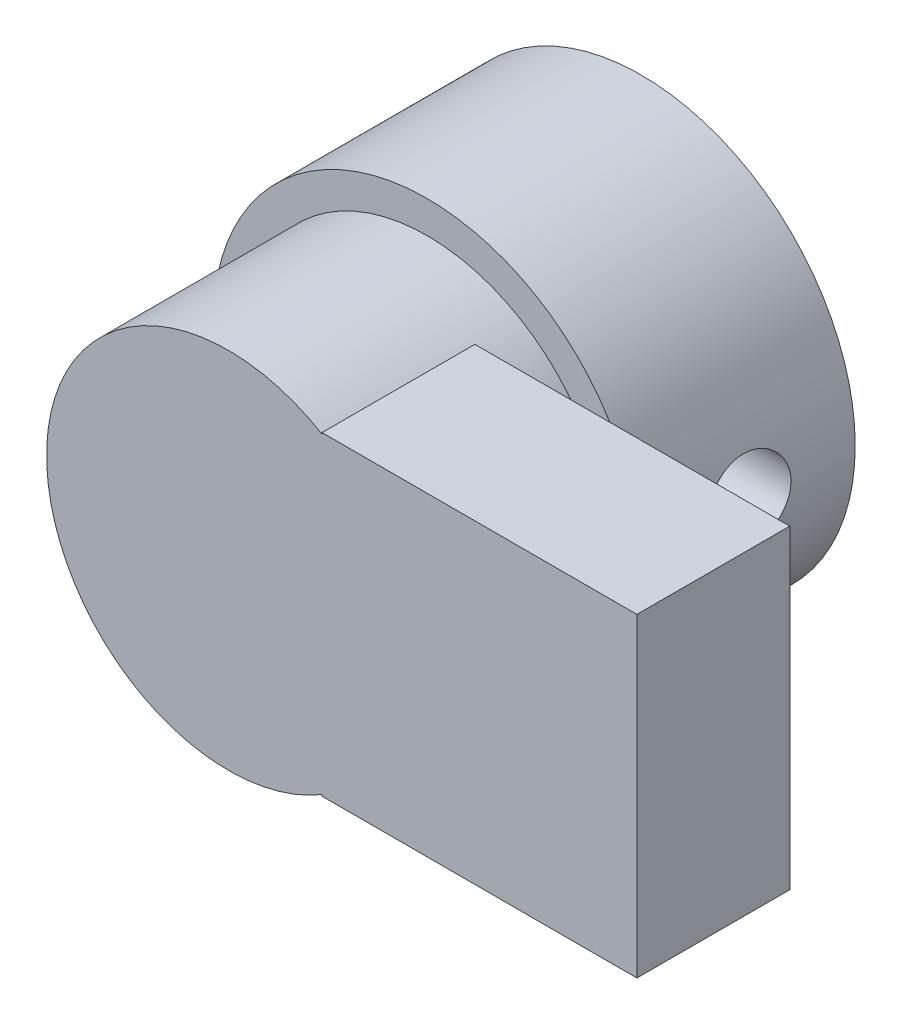
ISO-10303-21;
HEADER;
FILE_DESCRIPTION(('STEP AP214'),'2;1');
FILE_NAME('part.step','',(''),(''),'','','');
FILE_SCHEMA(('AUTOMOTIVE_DESIGN { 1 0 10303 214 1 1 1 1 }'));
ENDSEC;
DATA;
#1=APPLICATION_CONTEXT('core data for automotive mechanical design processes');
#2=APPLICATION_PROTOCOL_DEFINITION('international standard','automotive_design',2000,#1);
#3=PRODUCT_CONTEXT('',#1,'mechanical');
#4=PRODUCT('Part','Part','',(#3));
#5=PRODUCT_RELATED_PRODUCT_CATEGORY('part','',(#4));
#6=PRODUCT_DEFINITION_FORMATION('','',#4);
#7=PRODUCT_DEFINITION_CONTEXT('part definition',#1,'design');
#8=PRODUCT_DEFINITION('design','',#6,#7);
#9=PRODUCT_DEFINITION_SHAPE('','',#8);
#10=(LENGTH_UNIT() NAMED_UNIT(*) SI_UNIT(.MILLI.,.METRE.));
#11=(NAMED_UNIT(*) PLANE_ANGLE_UNIT() SI_UNIT($,.RADIAN.));
#12=(NAMED_UNIT(*) SI_UNIT($,.STERADIAN.) SOLID_ANGLE_UNIT());
#13=UNCERTAINTY_MEASURE_WITH_UNIT(LENGTH_MEASURE(1.E-05),#10,'distance_accuracy_value','');
#14=(GEOMETRIC_REPRESENTATION_CONTEXT(3) GLOBAL_UNCERTAINTY_ASSIGNED_CONTEXT((#13)) GLOBAL_UNIT_ASSIGNED_CONTEXT((#10,
#11,#12)) REPRESENTATION_CONTEXT('',''));
#15=CARTESIAN_POINT('',(0.,0.,0.));
#16=DIRECTION('',(0.,0.,1.));
#17=DIRECTION('',(1.,0.,0.));
#18=AXIS2_PLACEMENT_3D('',#15,#16,#17);
#19=CARTESIAN_POINT('',(-3.89226487777162,1.8205755073448,7.));
#20=DIRECTION('',(0.,0.,1.));
#21=DIRECTION('',(1.,0.,0.));
#22=AXIS2_PLACEMENT_3D('',#19,#20,#21);
#23=PLANE('',#22);
#24=CARTESIAN_POINT('',(-3.89226487777162,1.8205755073448,7.));
#25=DIRECTION('',(0.,0.,1.));
#26=DIRECTION('',(1.,0.,0.));
#27=AXIS2_PLACEMENT_3D('',#24,#25,#26);
#28=CIRCLE('',#27,7.);
#29=CARTESIAN_POINT('',(3.10773512222838,1.8205755073448,7.));
#30=VERTEX_POINT('',#29);
#31=EDGE_CURVE('E11',#30,#30,#28,.T.);
#32=ORIENTED_EDGE('',*,*,#31,.T.);
#33=EDGE_LOOP('',(#32));
#34=FACE_BOUND('',#33,.T.);
#35=CARTESIAN_POINT('',(-3.89226487777162,1.8205755073448,7.));
#36=DIRECTION('',(0.,0.,1.));
#37=DIRECTION('',(1.,0.,0.));
#38=AXIS2_PLACEMENT_3D('',#35,#36,#37);
#39=CIRCLE('',#38,5.95);
#40=CARTESIAN_POINT('',(2.05773512222838,1.8205755073448,7.));
#41=VERTEX_POINT('',#40);
#42=EDGE_CURVE('E151',#41,#41,#39,.T.);
#43=ORIENTED_EDGE('',*,*,#42,.F.);
#44=EDGE_LOOP('',(#43));
#45=FACE_BOUND('',#44,.T.);
#46=ADVANCED_FACE('F35',(#34,#45),#23,.T.);
#47=CARTESIAN_POINT('',(-3.89226487777162,1.8205755073448,0.));
#48=DIRECTION('',(0.,0.,1.));
#49=DIRECTION('',(1.,0.,0.));
#50=AXIS2_PLACEMENT_3D('',#47,#48,#49);
#51=PLANE('',#50);
#52=CARTESIAN_POINT('',(-3.89226487777162,1.8205755073448,0.));
#53=DIRECTION('',(0.,0.,1.));
#54=DIRECTION('',(1.,0.,0.));
#55=AXIS2_PLACEMENT_3D('',#52,#53,#54);
#56=CIRCLE('',#55,7.);
#57=CARTESIAN_POINT('',(3.10773512222838,1.8205755073448,0.));
#58=VERTEX_POINT('',#57);
#59=EDGE_CURVE('E49',#58,#58,#56,.T.);
#60=ORIENTED_EDGE('',*,*,#59,.F.);
#61=EDGE_LOOP('',(#60));
#62=FACE_BOUND('',#61,.T.);
#63=CARTESIAN_POINT('',(-3.89226487777162,1.8205755073448,0.));
#64=DIRECTION('',(0.,0.,1.));
#65=DIRECTION('',(1.,0.,0.));
#66=AXIS2_PLACEMENT_3D('',#63,#64,#65);
#67=CIRCLE('',#66,4.075);
#68=CARTESIAN_POINT('',(0.182735122228377,1.8205755073448,0.));
#69=VERTEX_POINT('',#68);
#70=EDGE_CURVE('E162',#69,#69,#67,.T.);
#71=ORIENTED_EDGE('',*,*,#70,.T.);
#72=EDGE_LOOP('',(#71));
#73=FACE_BOUND('',#72,.T.);
#74=ADVANCED_FACE('F211',(#62,#73),#51,.F.);
#75=CARTESIAN_POINT('',(-3.89226487777162,1.8205755073448,7.));
#76=DIRECTION('',(0.,0.,-1.));
#77=DIRECTION('',(-1.,0.,0.));
#78=AXIS2_PLACEMENT_3D('',#75,#76,#77);
#79=CYLINDRICAL_SURFACE('',#78,7.);
#80=CARTESIAN_POINT('',(2.95591006158266,3.2705755073448,3.5));
#81=CARTESIAN_POINT('',(2.95591163239822,3.27057262282342,3.42228407736087));
#82=CARTESIAN_POINT('',(2.95729482942923,3.26408218129355,3.3445319481475));
#83=CARTESIAN_POINT('',(2.96267351367451,3.23831538929964,3.19122946014402));
#84=CARTESIAN_POINT('',(2.96667109430326,3.21902879239491,3.11568091651348));
#85=CARTESIAN_POINT('',(2.97681878222101,3.16829719694544,2.96902786643036));
#86=CARTESIAN_POINT('',(2.98296665589913,3.13686481126842,2.89791883842486));
#87=CARTESIAN_POINT('',(2.99673826955036,3.06277084242376,2.76198665758734));
#88=CARTESIAN_POINT('',(3.00436193389014,3.0201098346755,2.69716318288016));
#89=CARTESIAN_POINT('',(3.02037989727742,2.92408666318833,2.57466099242202));
#90=CARTESIAN_POINT('',(3.02878322800462,2.8705875124419,2.51709082115908));
#91=CARTESIAN_POINT('',(3.04537323087999,2.75470472999993,2.41167480437154));
#92=CARTESIAN_POINT('',(3.05355988613739,2.6923204080726,2.36382971502751));
#93=CARTESIAN_POINT('',(3.06893011110751,2.55966948675821,2.27876355911787));
#94=CARTESIAN_POINT('',(3.07610280734206,2.48933016685277,2.24165375505523));
#95=CARTESIAN_POINT('',(3.08857900941407,2.34324709978843,2.17982171784878));
#96=CARTESIAN_POINT('',(3.09388268489595,2.26750384387653,2.15509836034499));
#97=CARTESIAN_POINT('',(3.10200874559316,2.11379886510703,2.11906105946346));
#98=CARTESIAN_POINT('',(3.10486235940933,2.03587854757293,2.10757769025154));
#99=CARTESIAN_POINT('',(3.10792840115894,1.8791672824412,2.0978274207758));
#100=CARTESIAN_POINT('',(3.10814110021225,1.80037642504561,2.09955916380137));
#101=CARTESIAN_POINT('',(3.10596630560319,1.64543149913103,2.11606050041411));
#102=CARTESIAN_POINT('',(3.10361840299164,1.56925554450138,2.13063092673798));
#103=CARTESIAN_POINT('',(3.09668679198969,1.42044216599389,2.17208934515411));
#104=CARTESIAN_POINT('',(3.09210301006967,1.34780485857516,2.19897774233602));
#105=CARTESIAN_POINT('',(3.08120995610346,1.20770038788268,2.26444104088192));
#106=CARTESIAN_POINT('',(3.07489211644235,1.14026108359072,2.3030740747906));
#107=CARTESIAN_POINT('',(3.06126203655566,1.01275031350458,2.39088764379634));
#108=CARTESIAN_POINT('',(3.05394968614079,0.952679665543605,2.44006934800837));
#109=CARTESIAN_POINT('',(3.03902549053282,0.840537917454938,2.54857363458813));
#110=CARTESIAN_POINT('',(3.0314106674996,0.788620110530382,2.6080543481672));
#111=CARTESIAN_POINT('',(3.01688540004545,0.695465825899548,2.7349431676754));
#112=CARTESIAN_POINT('',(3.00997497180675,0.654229593550282,2.80235145565014));
#113=CARTESIAN_POINT('',(2.99765455898175,0.583519193129233,2.94346461326006));
#114=CARTESIAN_POINT('',(2.99224907573691,0.554080198026942,3.01718752818991));
#115=CARTESIAN_POINT('',(2.98362259504455,0.508049180557843,3.16866072078417));
#116=CARTESIAN_POINT('',(2.98040133472358,0.491455612196742,3.24641051259708));
#117=CARTESIAN_POINT('',(2.97657164955696,0.471803986209175,3.40241883866334));
#118=CARTESIAN_POINT('',(2.97592286747992,0.468536839045082,3.48065006853152));
#119=CARTESIAN_POINT('',(2.9772052173132,0.475067682807163,3.63654046212058));
#120=CARTESIAN_POINT('',(2.97913621191971,0.484864978402692,3.7141996560658));
#121=CARTESIAN_POINT('',(2.98531575380044,0.5170623379064,3.86601927390649));
#122=CARTESIAN_POINT('',(2.9895431523705,0.539347453618915,3.94020501604292));
#123=CARTESIAN_POINT('',(2.9998072456457,0.595765747680533,4.08379054809406));
#124=CARTESIAN_POINT('',(3.00584408352989,0.629899863662495,4.15318995873658));
#125=CARTESIAN_POINT('',(3.01911903486734,0.709532954344009,4.28616774361214));
#126=CARTESIAN_POINT('',(3.02637094518383,0.755165897783828,4.34966448770316));
#127=CARTESIAN_POINT('',(3.04119237892614,0.856325708560474,4.46817786097498));
#128=CARTESIAN_POINT('',(3.04876193253041,0.911853517616498,4.52319368207473));
#129=CARTESIAN_POINT('',(3.06346094712948,1.03216264501846,4.62396897735524));
#130=CARTESIAN_POINT('',(3.07058275787058,1.09706269190324,4.66958799141463));
#131=CARTESIAN_POINT('',(3.08342998564081,1.23373226257049,4.74927450643541));
#132=CARTESIAN_POINT('',(3.08915546909011,1.30550145937662,4.78334255688044));
#133=CARTESIAN_POINT('',(3.09848917922306,1.45341221951954,4.83871962420325));
#134=CARTESIAN_POINT('',(3.10211073949181,1.52952281432936,4.86010900992508));
#135=CARTESIAN_POINT('',(3.10683712089213,1.68432945918584,4.88979208610067));
#136=CARTESIAN_POINT('',(3.10794223541393,1.76302520674636,4.89808730315771));
#137=CARTESIAN_POINT('',(3.10746736019083,1.91935501619308,4.90129614861017));
#138=CARTESIAN_POINT('',(3.10593209039936,1.9969847497915,4.89643186102668));
#139=CARTESIAN_POINT('',(3.10038679976104,2.1502830233962,4.87395965976479));
#140=CARTESIAN_POINT('',(3.09637679222606,2.22595157394963,4.85635181463529));
#141=CARTESIAN_POINT('',(3.0862817246706,2.37314085745916,4.80896927848086));
#142=CARTESIAN_POINT('',(3.08019872316187,2.44466562312858,4.77920665152863));
#143=CARTESIAN_POINT('',(3.06657030740713,2.58173415434224,4.70838970198351));
#144=CARTESIAN_POINT('',(3.05902476929775,2.64727741261599,4.66733442288369));
#145=CARTESIAN_POINT('',(3.04310300897442,2.77172169182453,4.57427827565965));
#146=CARTESIAN_POINT('',(3.03471487574052,2.83049131496114,4.52210369542089));
#147=CARTESIAN_POINT('',(3.01810422582736,2.9385169811892,4.40864611909754));
#148=CARTESIAN_POINT('',(3.00988174885477,2.98777076713876,4.34736096808452));
#149=CARTESIAN_POINT('',(2.99441143778617,3.07585051680518,4.21665071057743));
#150=CARTESIAN_POINT('',(2.98717462741745,3.11456272289131,4.14714758854431));
#151=CARTESIAN_POINT('',(2.97460573033101,3.17969181376764,4.0024881899737));
#152=CARTESIAN_POINT('',(2.96927189234048,3.2061200101401,3.92733718860858));
#153=CARTESIAN_POINT('',(2.96216895836305,3.24077189327854,3.7933417005766));
#154=CARTESIAN_POINT('',(2.9598361068866,3.25192808612843,3.73526768974866));
#155=CARTESIAN_POINT('',(2.95670608970042,3.2668308531963,3.61813606946411));
#156=CARTESIAN_POINT('',(2.95590886747188,3.27057770011534,3.5590784962882));
#157=CARTESIAN_POINT('',(2.95591006158266,3.2705755073448,3.5));
#158=B_SPLINE_CURVE_WITH_KNOTS('',3,(#80,#81,#82,#83,#84,#85,#86,#87,#88,#89,#90,#91,#92,#93,
#94,#95,#96,#97,#98,#99,#100,#101,#102,#103,#104,#105,#106,#107,#108,#109,#110,#111,#112,#113,
#114,#115,#116,#117,#118,#119,#120,#121,#122,#123,#124,#125,#126,#127,#128,#129,#130,#131,#132,
#133,#134,#135,#136,#137,#138,#139,#140,#141,#142,#143,#144,#145,#146,#147,#148,#149,#150,#151,
#152,#153,#154,#155,#156,#157),.UNSPECIFIED.,.T.,.F.,(4,2,2,2,2,2,2,2,2,2,2,2,2,2,2,2,2,2,2,2,2,
2,2,2,2,2,2,2,2,2,2,2,2,2,2,2,2,2,4),(0.,0.232931227716127,0.466049199115014,0.698925735526659,
0.931790340323705,1.16780584542414,1.4038396950614,1.64223872875985,1.88061611824266,
2.11590801229781,2.35117575077178,2.58285678302257,2.81454543489906,3.04740008405624,
3.28028055397079,3.51711861134157,3.75396210842779,3.99150658264515,4.22902246306572,
4.46279707620362,4.69655924761953,4.92820421203426,5.15986751111493,5.39436585767635,
5.62888653396527,5.86669241467288,6.10448698127857,6.34075760833079,6.57700068738261,
6.80928183176536,7.04156172669312,7.27361163334636,7.50568120107895,7.74168385403417,
7.97774241791055,8.21625559900873,8.454548710865,8.63162610652447,8.80869698472704),.UNSPECIFIED.);
#159=CARTESIAN_POINT('',(2.95591006158266,3.2705755073448,3.5));
#160=VERTEX_POINT('',#159);
#161=EDGE_CURVE('E135',#160,#160,#158,.T.);
#162=ORIENTED_EDGE('',*,*,#161,.T.);
#163=EDGE_LOOP('',(#162));
#164=FACE_BOUND('',#163,.T.);
#165=ORIENTED_EDGE('',*,*,#31,.F.);
#166=EDGE_LOOP('',(#165));
#167=FACE_BOUND('',#166,.T.);
#168=ORIENTED_EDGE('',*,*,#59,.T.);
#169=EDGE_LOOP('',(#168));
#170=FACE_BOUND('',#169,.T.);
#171=ADVANCED_FACE('F37',(#164,#167,#170),#79,.T.);
#172=CARTESIAN_POINT('',(-3.89226487777162,1.8205755073448,7.));
#173=DIRECTION('',(0.,0.,-1.));
#174=DIRECTION('',(-1.,0.,0.));
#175=AXIS2_PLACEMENT_3D('',#172,#173,#174);
#176=CYLINDRICAL_SURFACE('',#175,4.075);
#177=CARTESIAN_POINT('',(-0.0839680143430378,3.2705755073448,3.5));
#178=CARTESIAN_POINT('',(-0.083968771930213,3.27057643234761,3.42412004906718));
#179=CARTESIAN_POINT('',(-0.0815938923373971,3.26438520654729,3.34824636595262));
#180=CARTESIAN_POINT('',(-0.0724000130995654,3.23987995873879,3.19876335696625));
#181=CARTESIAN_POINT('',(-0.0655804534598459,3.22156440915668,3.12515431764568));
#182=CARTESIAN_POINT('',(-0.0483452852143103,3.17355357129867,2.98239996505927));
#183=CARTESIAN_POINT('',(-0.0379375690974396,3.1438832432976,2.91324524704929));
#184=CARTESIAN_POINT('',(-0.0146809379680881,3.07409691677165,2.78087673937624));
#185=CARTESIAN_POINT('',(-0.00183141609120055,3.03397832060807,2.71766443243634));
#186=CARTESIAN_POINT('',(0.0255400501800285,2.94253484674486,2.59616681961168));
#187=CARTESIAN_POINT('',(0.0401085378793462,2.89082334355552,2.53818294627327));
#188=CARTESIAN_POINT('',(0.0689697244273376,2.77849247191192,2.43150168373232));
#189=CARTESIAN_POINT('',(0.0832623686012235,2.71787135759221,2.38280611890921));
#190=CARTESIAN_POINT('',(0.110574933456284,2.58705941598464,2.29456629907436));
#191=CARTESIAN_POINT('',(0.123539231377472,2.51662375912911,2.25536620760843));
#192=CARTESIAN_POINT('',(0.146259277521711,2.36963617269217,2.18949669808926));
#193=CARTESIAN_POINT('',(0.156015915128713,2.29308594581916,2.16282380575475));
#194=CARTESIAN_POINT('',(0.170989992987225,2.13894894908524,2.12374884714824));
#195=CARTESIAN_POINT('',(0.176358083866577,2.06149850618678,2.11086797220186));
#196=CARTESIAN_POINT('',(0.18260111176823,1.90536358619584,2.09824426368363));
#197=CARTESIAN_POINT('',(0.183477381631438,1.82667948211484,2.09849753261938));
#198=CARTESIAN_POINT('',(0.180783598710721,1.67404024717055,2.11184215528485));
#199=CARTESIAN_POINT('',(0.177409931804736,1.60003062668927,2.12436094796621));
#200=CARTESIAN_POINT('',(0.166971863473575,1.4552048652104,2.16095308571409));
#201=CARTESIAN_POINT('',(0.159907268236165,1.38438889212477,2.18502703754159));
#202=CARTESIAN_POINT('',(0.142781557116892,1.24711060682903,2.24423880901373));
#203=CARTESIAN_POINT('',(0.132691582628109,1.18069810587335,2.27948337693624));
#204=CARTESIAN_POINT('',(0.110604094217999,1.05456570462155,2.35994386838224));
#205=CARTESIAN_POINT('',(0.0986060554563707,0.994847653457217,2.4051625367526));
#206=CARTESIAN_POINT('',(0.073330592611241,0.880758064638954,2.50683517903845));
#207=CARTESIAN_POINT('',(0.060019388370782,0.826781903368989,2.56372498059909));
#208=CARTESIAN_POINT('',(0.0341359078658583,0.728986207101934,2.68581748996863));
#209=CARTESIAN_POINT('',(0.0215637630489998,0.685168474807266,2.75102167005964));
#210=CARTESIAN_POINT('',(-0.0015713311541868,0.608231667213792,2.88937636416805));
#211=CARTESIAN_POINT('',(-0.0120945682495801,0.575316737842686,2.96264758406263));
#212=CARTESIAN_POINT('',(-0.0294683863337951,0.522418240388801,3.11412348273987));
#213=CARTESIAN_POINT('',(-0.0363204627410457,0.502429406274991,3.19232613820977));
#214=CARTESIAN_POINT('',(-0.045200583247418,0.476737939952615,3.34782793083892));
#215=CARTESIAN_POINT('',(-0.0474243590775059,0.470455088238629,3.42501998742806));
#216=CARTESIAN_POINT('',(-0.04733826046605,0.470699372077785,3.5793727801923));
#217=CARTESIAN_POINT('',(-0.0450292375670658,0.477224101567649,3.656533519527));
#218=CARTESIAN_POINT('',(-0.0363479670327919,0.502359425978249,3.80579976854274));
#219=CARTESIAN_POINT('',(-0.0301214662597124,0.520536928530367,3.87798762943348));
#220=CARTESIAN_POINT('',(-0.0144909584552917,0.567933197862199,4.01827355222772));
#221=CARTESIAN_POINT('',(-0.00508638653352552,0.597153927644184,4.08637088451875));
#222=CARTESIAN_POINT('',(0.0161708299309362,0.66683487823053,4.21887722558782));
#223=CARTESIAN_POINT('',(0.0280901183707808,0.707614388058947,4.28310733806171));
#224=CARTESIAN_POINT('',(0.0528663081666649,0.798910870812702,4.40403454490538));
#225=CARTESIAN_POINT('',(0.0657234848540207,0.84943071036912,4.46072941329376));
#226=CARTESIAN_POINT('',(0.0916149456889474,0.961628437704805,4.56775723583735));
#227=CARTESIAN_POINT('',(0.104628686383551,1.0237220246689,4.61766067711961));
#228=CARTESIAN_POINT('',(0.128693966116616,1.1557372427687,4.70637006423935));
#229=CARTESIAN_POINT('',(0.139745605809592,1.22565847205119,4.74517657940439));
#230=CARTESIAN_POINT('',(0.158498212190747,1.37085296555589,4.81017089912761));
#231=CARTESIAN_POINT('',(0.166226788033599,1.44607583676317,4.83646288261192));
#232=CARTESIAN_POINT('',(0.177502758433075,1.60017961706238,4.87593829780494));
#233=CARTESIAN_POINT('',(0.181051715029161,1.67905914809674,4.88912662642408));
#234=CARTESIAN_POINT('',(0.183414780749003,1.83412938505582,4.9015807574672));
#235=CARTESIAN_POINT('',(0.182449484597438,1.91026574070714,4.90148877200299));
#236=CARTESIAN_POINT('',(0.17631842255705,2.06134431371142,4.88901093793162));
#237=CARTESIAN_POINT('',(0.171152953006305,2.13628661492909,4.87662595662808));
#238=CARTESIAN_POINT('',(0.157200335838856,2.28180045317982,4.84031325100077));
#239=CARTESIAN_POINT('',(0.148465925183307,2.3524191025235,4.81655277546319));
#240=CARTESIAN_POINT('',(0.128185883117961,2.48867015951723,4.75835224282986));
#241=CARTESIAN_POINT('',(0.116639697658555,2.55430158110467,4.72391008058178));
#242=CARTESIAN_POINT('',(0.0912707937234331,2.68165536567703,4.64369724163824));
#243=CARTESIAN_POINT('',(0.0773740109057789,2.74310618170594,4.5975191253318));
#244=CARTESIAN_POINT('',(0.049017360375223,2.85759246690414,4.49582332144152));
#245=CARTESIAN_POINT('',(0.0345573006927504,2.91062503525379,4.44030242797505));
#246=CARTESIAN_POINT('',(0.00592141366692435,3.00906659645995,4.31866635788851));
#247=CARTESIAN_POINT('',(-0.00821621909384365,3.05405582754032,4.25220122350261));
#248=CARTESIAN_POINT('',(-0.0338974793720673,3.13218724785537,4.11217585645765));
#249=CARTESIAN_POINT('',(-0.0454416700102722,3.1653320098351,4.03861716900738));
#250=CARTESIAN_POINT('',(-0.0641953360727266,3.21781127721506,3.88868144379438));
#251=CARTESIAN_POINT('',(-0.071523634922047,3.23752757184827,3.81245351970659));
#252=CARTESIAN_POINT('',(-0.0814085412657722,3.26390636258738,3.65748073945096));
#253=CARTESIAN_POINT('',(-0.0839672282310653,3.27057454751363,3.57873699537653));
#254=CARTESIAN_POINT('',(-0.0839680143430378,3.2705755073448,3.5));
#255=B_SPLINE_CURVE_WITH_KNOTS('',3,(#177,#178,#179,#180,#181,#182,#183,#184,#185,#186,#187,
#188,#189,#190,#191,#192,#193,#194,#195,#196,#197,#198,#199,#200,#201,#202,#203,#204,#205,#206,
#207,#208,#209,#210,#211,#212,#213,#214,#215,#216,#217,#218,#219,#220,#221,#222,#223,#224,#225,
#226,#227,#228,#229,#230,#231,#232,#233,#234,#235,#236,#237,#238,#239,#240,#241,#242,#243,#244,
#245,#246,#247,#248,#249,#250,#251,#252,#253,#254),.UNSPECIFIED.,.T.,.F.,(4,2,2,2,2,2,2,2,2,2,2,
2,2,2,2,2,2,2,2,2,2,2,2,2,2,2,2,2,2,2,2,2,2,2,2,2,2,2,4),(0.,0.227346914027018,0.45472247751452,
0.681601064618547,0.90853611200252,1.1446214400352,1.38075309153939,1.62446899426488,
1.86811726508578,2.10300155613119,2.33781614682124,2.56216752531888,2.78653068578808,
3.01310604585609,3.23974383684907,3.47728382107404,3.71486592664332,3.95667363331684,
4.19838276649118,4.42964314512748,4.66086008278591,4.88394582381008,5.107071238377,
5.33708860288562,5.5671737663541,5.80817630240618,6.04916647160911,6.28811379265113,
6.52697178409477,6.75428309512585,6.98157836987786,7.20562991457783,7.42972564356213,
7.663032174121,7.89641892539613,8.13972403146373,8.3829762568978,8.61898619494445,
8.85489321252361),.UNSPECIFIED.);
#256=CARTESIAN_POINT('',(-0.0839680143430378,3.2705755073448,3.5));
#257=VERTEX_POINT('',#256);
#258=EDGE_CURVE('E40',#257,#257,#255,.T.);
#259=ORIENTED_EDGE('',*,*,#258,.F.);
#260=EDGE_LOOP('',(#259));
#261=FACE_BOUND('',#260,.T.);
#262=CARTESIAN_POINT('',(-3.89226487777162,1.8205755073448,7.));
#263=DIRECTION('',(0.,0.,1.));
#264=DIRECTION('',(1.,0.,0.));
#265=AXIS2_PLACEMENT_3D('',#262,#263,#264);
#266=CIRCLE('',#265,4.075);
#267=CARTESIAN_POINT('',(0.182735122228377,1.8205755073448,7.));
#268=VERTEX_POINT('',#267);
#269=EDGE_CURVE('E159',#268,#268,#266,.T.);
#270=ORIENTED_EDGE('',*,*,#269,.T.);
#271=EDGE_LOOP('',(#270));
#272=FACE_BOUND('',#271,.T.);
#273=ORIENTED_EDGE('',*,*,#70,.F.);
#274=EDGE_LOOP('',(#273));
#275=FACE_BOUND('',#274,.T.);
#276=ADVANCED_FACE('F203',(#261,#272,#275),#176,.F.);
#277=CARTESIAN_POINT('',(-3.89226487777162,1.8205755073448,7.));
#278=DIRECTION('',(0.,0.,1.));
#279=DIRECTION('',(1.,0.,0.));
#280=AXIS2_PLACEMENT_3D('',#277,#278,#279);
#281=PLANE('',#280);
#282=ORIENTED_EDGE('',*,*,#269,.F.);
#283=EDGE_LOOP('',(#282));
#284=FACE_BOUND('',#283,.T.);
#285=ADVANCED_FACE('F200',(#284),#281,.F.);
#286=CARTESIAN_POINT('',(-3.89226487777162,1.8205755073448,8.5));
#287=DIRECTION('',(0.,0.,-1.));
#288=DIRECTION('',(-1.,0.,0.));
#289=AXIS2_PLACEMENT_3D('',#286,#287,#288);
#290=CYLINDRICAL_SURFACE('',#289,5.95);
#291=CARTESIAN_POINT('',(-3.89226487777162,1.8205755073448,8.5));
#292=DIRECTION('',(0.,0.,1.));
#293=DIRECTION('',(1.,0.,0.));
#294=AXIS2_PLACEMENT_3D('',#291,#292,#293);
#295=CIRCLE('',#294,5.95);
#296=CARTESIAN_POINT('',(-0.833245427032546,-3.28284491429401,8.5));
#297=VERTEX_POINT('',#296);
#298=CARTESIAN_POINT('',(-0.833245427032546,6.9239959289836,8.5));
#299=VERTEX_POINT('',#298);
#300=EDGE_CURVE('E57',#297,#299,#295,.T.);
#301=ORIENTED_EDGE('',*,*,#300,.F.);
#302=DIRECTION('',(0.,0.,-1.));
#303=VECTOR('',#302,1.);
#304=CARTESIAN_POINT('',(-0.833245427032547,-3.28284491429401,13.5));
#305=LINE('',#304,#303);
#306=CARTESIAN_POINT('',(-0.833245427032547,-3.28284491429401,13.5));
#307=VERTEX_POINT('',#306);
#308=EDGE_CURVE('E123',#307,#297,#305,.T.);
#309=ORIENTED_EDGE('',*,*,#308,.F.);
#310=CARTESIAN_POINT('',(-3.89226487777162,1.8205755073448,13.5));
#311=DIRECTION('',(0.,0.,1.));
#312=DIRECTION('',(1.,0.,0.));
#313=AXIS2_PLACEMENT_3D('',#310,#311,#312);
#314=CIRCLE('',#313,5.95);
#315=CARTESIAN_POINT('',(-0.833245427032546,6.9239959289836,13.5));
#316=VERTEX_POINT('',#315);
#317=EDGE_CURVE('E112',#316,#307,#314,.T.);
#318=ORIENTED_EDGE('',*,*,#317,.F.);
#319=DIRECTION('',(0.,0.,-1.));
#320=VECTOR('',#319,1.);
#321=CARTESIAN_POINT('',(-0.833245427032546,6.9239959289836,13.5));
#322=LINE('',#321,#320);
#323=EDGE_CURVE('E148',#316,#299,#322,.T.);
#324=ORIENTED_EDGE('',*,*,#323,.T.);
#325=EDGE_LOOP('',(#301,#309,#318,#324));
#326=FACE_BOUND('',#325,.T.);
#327=ORIENTED_EDGE('',*,*,#42,.T.);
#328=EDGE_LOOP('',(#327));
#329=FACE_BOUND('',#328,.T.);
#330=ADVANCED_FACE('F171',(#326,#329),#290,.T.);
#331=CARTESIAN_POINT('',(0.,0.,8.5));
#332=DIRECTION('',(0.,0.,1.));
#333=DIRECTION('',(1.,0.,0.));
#334=AXIS2_PLACEMENT_3D('',#331,#332,#333);
#335=PLANE('',#334);
#336=DIRECTION('',(0.,-1.,0.));
#337=VECTOR('',#336,1.);
#338=CARTESIAN_POINT('',(-0.833245427032547,0.,8.5));
#339=LINE('',#338,#337);
#340=CARTESIAN_POINT('',(-0.833245427032547,-3.3294244926552,8.5));
#341=VERTEX_POINT('',#340);
#342=EDGE_CURVE('E119',#297,#341,#339,.T.);
#343=ORIENTED_EDGE('',*,*,#342,.F.);
#344=ORIENTED_EDGE('',*,*,#300,.T.);
#345=CARTESIAN_POINT('',(-0.833245427032546,6.9705755073448,8.5));
#346=VERTEX_POINT('',#345);
#347=EDGE_CURVE('E134',#346,#299,#339,.T.);
#348=ORIENTED_EDGE('',*,*,#347,.F.);
#349=DIRECTION('',(-1.,0.,0.));
#350=VECTOR('',#349,1.);
#351=CARTESIAN_POINT('',(0.,6.9705755073448,8.5));
#352=LINE('',#351,#350);
#353=CARTESIAN_POINT('',(9.46675457296745,6.9705755073448,8.5));
#354=VERTEX_POINT('',#353);
#355=EDGE_CURVE('E132',#354,#346,#352,.T.);
#356=ORIENTED_EDGE('',*,*,#355,.F.);
#357=DIRECTION('',(0.,-1.,0.));
#358=VECTOR('',#357,1.);
#359=CARTESIAN_POINT('',(9.46675457296745,0.,8.5));
#360=LINE('',#359,#358);
#361=CARTESIAN_POINT('',(9.46675457296745,-3.3294244926552,8.5));
#362=VERTEX_POINT('',#361);
#363=EDGE_CURVE('E174',#354,#362,#360,.T.);
#364=ORIENTED_EDGE('',*,*,#363,.T.);
#365=DIRECTION('',(-1.,0.,0.));
#366=VECTOR('',#365,1.);
#367=CARTESIAN_POINT('',(0.,-3.3294244926552,8.5));
#368=LINE('',#367,#366);
#369=EDGE_CURVE('E138',#362,#341,#368,.T.);
#370=ORIENTED_EDGE('',*,*,#369,.T.);
#371=EDGE_LOOP('',(#343,#344,#348,#356,#364,#370));
#372=FACE_BOUND('',#371,.T.);
#373=ADVANCED_FACE('F169',(#372),#335,.F.);
#374=CARTESIAN_POINT('',(0.,6.9705755073448,13.5));
#375=DIRECTION('',(0.,-1.,0.));
#376=DIRECTION('',(1.,0.,0.));
#377=AXIS2_PLACEMENT_3D('',#374,#375,#376);
#378=PLANE('',#377);
#379=ORIENTED_EDGE('',*,*,#355,.T.);
#380=DIRECTION('',(0.,0.,-1.));
#381=VECTOR('',#380,1.);
#382=CARTESIAN_POINT('',(-0.833245427032546,6.9705755073448,13.5));
#383=LINE('',#382,#381);
#384=CARTESIAN_POINT('',(-0.833245427032546,6.9705755073448,13.5));
#385=VERTEX_POINT('',#384);
#386=EDGE_CURVE('E150',#385,#346,#383,.T.);
#387=ORIENTED_EDGE('',*,*,#386,.F.);
#388=DIRECTION('',(-1.,0.,0.));
#389=VECTOR('',#388,1.);
#390=CARTESIAN_POINT('',(0.,6.9705755073448,13.5));
#391=LINE('',#390,#389);
#392=CARTESIAN_POINT('',(9.46675457296745,6.9705755073448,13.5));
#393=VERTEX_POINT('',#392);
#394=EDGE_CURVE('E173',#393,#385,#391,.T.);
#395=ORIENTED_EDGE('',*,*,#394,.F.);
#396=DIRECTION('',(0.,0.,-1.));
#397=VECTOR('',#396,1.);
#398=CARTESIAN_POINT('',(9.46675457296745,6.9705755073448,13.5));
#399=LINE('',#398,#397);
#400=EDGE_CURVE('E66',#393,#354,#399,.T.);
#401=ORIENTED_EDGE('',*,*,#400,.T.);
#402=EDGE_LOOP('',(#379,#387,#395,#401));
#403=FACE_BOUND('',#402,.T.);
#404=ADVANCED_FACE('F191',(#403),#378,.F.);
#405=CARTESIAN_POINT('',(-0.833245427032547,0.,13.5));
#406=DIRECTION('',(1.,0.,0.));
#407=DIRECTION('',(0.,1.,0.));
#408=AXIS2_PLACEMENT_3D('',#405,#406,#407);
#409=PLANE('',#408);
#410=ORIENTED_EDGE('',*,*,#347,.T.);
#411=ORIENTED_EDGE('',*,*,#323,.F.);
#412=DIRECTION('',(0.,-1.,0.));
#413=VECTOR('',#412,1.);
#414=CARTESIAN_POINT('',(-0.833245427032547,0.,13.5));
#415=LINE('',#414,#413);
#416=EDGE_CURVE('E95',#385,#316,#415,.T.);
#417=ORIENTED_EDGE('',*,*,#416,.F.);
#418=ORIENTED_EDGE('',*,*,#386,.T.);
#419=EDGE_LOOP('',(#410,#411,#417,#418));
#420=FACE_BOUND('',#419,.T.);
#421=ADVANCED_FACE('F170',(#420),#409,.F.);
#422=ORIENTED_EDGE('',*,*,#342,.T.);
#423=DIRECTION('',(0.,0.,-1.));
#424=VECTOR('',#423,1.);
#425=CARTESIAN_POINT('',(-0.833245427032547,-3.3294244926552,13.5));
#426=LINE('',#425,#424);
#427=CARTESIAN_POINT('',(-0.833245427032547,-3.3294244926552,13.5));
#428=VERTEX_POINT('',#427);
#429=EDGE_CURVE('E116',#428,#341,#426,.T.);
#430=ORIENTED_EDGE('',*,*,#429,.F.);
#431=EDGE_CURVE('E105',#307,#428,#415,.T.);
#432=ORIENTED_EDGE('',*,*,#431,.F.);
#433=ORIENTED_EDGE('',*,*,#308,.T.);
#434=EDGE_LOOP('',(#422,#430,#432,#433));
#435=FACE_BOUND('',#434,.T.);
#436=ADVANCED_FACE('F117',(#435),#409,.F.);
#437=CARTESIAN_POINT('',(0.,-3.3294244926552,13.5));
#438=DIRECTION('',(0.,-1.,0.));
#439=DIRECTION('',(1.,0.,0.));
#440=AXIS2_PLACEMENT_3D('',#437,#438,#439);
#441=PLANE('',#440);
#442=ORIENTED_EDGE('',*,*,#369,.F.);
#443=DIRECTION('',(0.,0.,-1.));
#444=VECTOR('',#443,1.);
#445=CARTESIAN_POINT('',(9.46675457296745,-3.3294244926552,13.5));
#446=LINE('',#445,#444);
#447=CARTESIAN_POINT('',(9.46675457296745,-3.3294244926552,13.5));
#448=VERTEX_POINT('',#447);
#449=EDGE_CURVE('E124',#448,#362,#446,.T.);
#450=ORIENTED_EDGE('',*,*,#449,.F.);
#451=DIRECTION('',(-1.,0.,0.));
#452=VECTOR('',#451,1.);
#453=CARTESIAN_POINT('',(0.,-3.3294244926552,13.5));
#454=LINE('',#453,#452);
#455=EDGE_CURVE('E110',#448,#428,#454,.T.);
#456=ORIENTED_EDGE('',*,*,#455,.T.);
#457=ORIENTED_EDGE('',*,*,#429,.T.);
#458=EDGE_LOOP('',(#442,#450,#456,#457));
#459=FACE_BOUND('',#458,.T.);
#460=ADVANCED_FACE('F126',(#459),#441,.T.);
#461=CARTESIAN_POINT('',(9.46675457296745,0.,13.5));
#462=DIRECTION('',(1.,0.,0.));
#463=DIRECTION('',(0.,1.,0.));
#464=AXIS2_PLACEMENT_3D('',#461,#462,#463);
#465=PLANE('',#464);
#466=ORIENTED_EDGE('',*,*,#363,.F.);
#467=ORIENTED_EDGE('',*,*,#400,.F.);
#468=DIRECTION('',(0.,-1.,0.));
#469=VECTOR('',#468,1.);
#470=CARTESIAN_POINT('',(9.46675457296745,0.,13.5));
#471=LINE('',#470,#469);
#472=EDGE_CURVE('E127',#393,#448,#471,.T.);
#473=ORIENTED_EDGE('',*,*,#472,.T.);
#474=ORIENTED_EDGE('',*,*,#449,.T.);
#475=EDGE_LOOP('',(#466,#467,#473,#474));
#476=FACE_BOUND('',#475,.T.);
#477=ADVANCED_FACE('F188',(#476),#465,.T.);
#478=CARTESIAN_POINT('',(0.,0.,13.5));
#479=DIRECTION('',(0.,0.,1.));
#480=DIRECTION('',(1.,0.,0.));
#481=AXIS2_PLACEMENT_3D('',#478,#479,#480);
#482=PLANE('',#481);
#483=ORIENTED_EDGE('',*,*,#394,.T.);
#484=ORIENTED_EDGE('',*,*,#416,.T.);
#485=ORIENTED_EDGE('',*,*,#317,.T.);
#486=ORIENTED_EDGE('',*,*,#431,.T.);
#487=ORIENTED_EDGE('',*,*,#455,.F.);
#488=ORIENTED_EDGE('',*,*,#472,.F.);
#489=EDGE_LOOP('',(#483,#484,#485,#486,#487,#488));
#490=FACE_BOUND('',#489,.T.);
#491=ADVANCED_FACE('F107',(#490),#482,.T.);
#492=CARTESIAN_POINT('',(-0.533245427032548,1.8705755073448,3.5));
#493=DIRECTION('',(1.,0.,0.));
#494=DIRECTION('',(0.,1.,0.));
#495=AXIS2_PLACEMENT_3D('',#492,#493,#494);
#496=CYLINDRICAL_SURFACE('',#495,1.4);
#497=ORIENTED_EDGE('',*,*,#258,.T.);
#498=EDGE_LOOP('',(#497));
#499=FACE_BOUND('',#498,.T.);
#500=ORIENTED_EDGE('',*,*,#161,.F.);
#501=EDGE_LOOP('',(#500));
#502=FACE_BOUND('',#501,.T.);
#503=ADVANCED_FACE('F180',(#499,#502),#496,.F.);
#504=CLOSED_SHELL('',(#46,#74,#171,#276,#285,#330,#373,#404,#421,#436,#460,#477,#491,#503));
#505=MANIFOLD_SOLID_BREP('B2',#504);
#506=ADVANCED_BREP_SHAPE_REPRESENTATION('',(#18,#505),#14);
#507=SHAPE_DEFINITION_REPRESENTATION(#9,#506);
ENDSEC;
END-ISO-10303-21;
